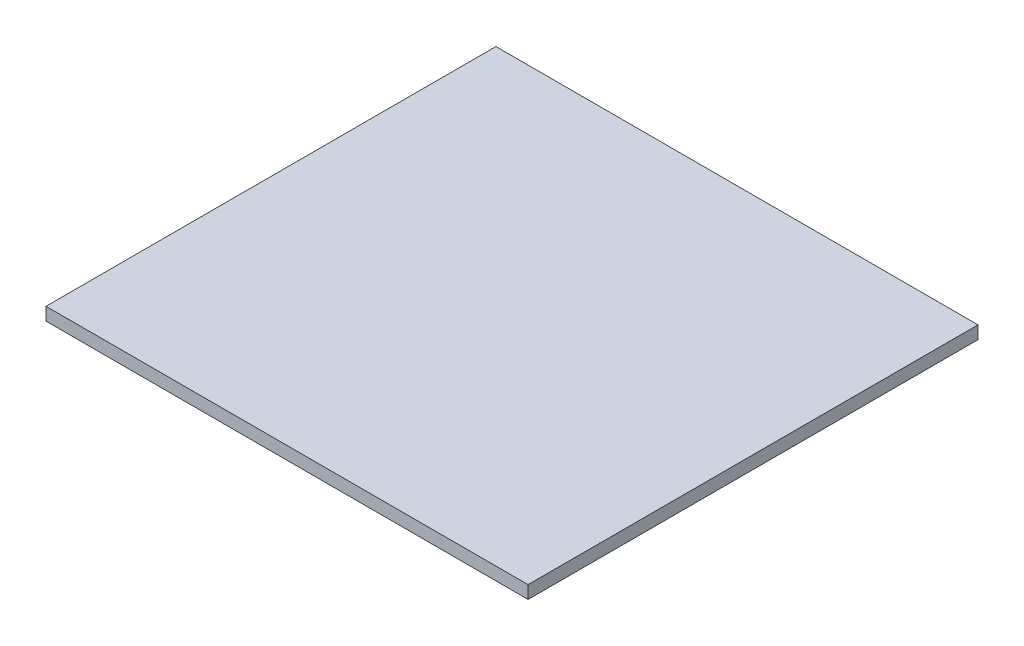
ISO-10303-21;
HEADER;
FILE_DESCRIPTION(('STEP AP214'),'2;1');
FILE_NAME('part.step','',(''),(''),'','','');
FILE_SCHEMA(('AUTOMOTIVE_DESIGN { 1 0 10303 214 1 1 1 1 }'));
ENDSEC;
DATA;
#1=APPLICATION_CONTEXT('core data for automotive mechanical design processes');
#2=APPLICATION_PROTOCOL_DEFINITION('international standard','automotive_design',2000,#1);
#3=PRODUCT_CONTEXT('',#1,'mechanical');
#4=PRODUCT('Part','Part','',(#3));
#5=PRODUCT_RELATED_PRODUCT_CATEGORY('part','',(#4));
#6=PRODUCT_DEFINITION_FORMATION('','',#4);
#7=PRODUCT_DEFINITION_CONTEXT('part definition',#1,'design');
#8=PRODUCT_DEFINITION('design','',#6,#7);
#9=PRODUCT_DEFINITION_SHAPE('','',#8);
#10=(LENGTH_UNIT() NAMED_UNIT(*) SI_UNIT(.MILLI.,.METRE.));
#11=(NAMED_UNIT(*) PLANE_ANGLE_UNIT() SI_UNIT($,.RADIAN.));
#12=(NAMED_UNIT(*) SI_UNIT($,.STERADIAN.) SOLID_ANGLE_UNIT());
#13=UNCERTAINTY_MEASURE_WITH_UNIT(LENGTH_MEASURE(1.E-05),#10,'distance_accuracy_value','');
#14=(GEOMETRIC_REPRESENTATION_CONTEXT(3) GLOBAL_UNCERTAINTY_ASSIGNED_CONTEXT((#13)) GLOBAL_UNIT_ASSIGNED_CONTEXT((#10,
#11,#12)) REPRESENTATION_CONTEXT('',''));
#15=CARTESIAN_POINT('',(0.,0.,0.));
#16=DIRECTION('',(0.,0.,1.));
#17=DIRECTION('',(1.,0.,0.));
#18=AXIS2_PLACEMENT_3D('',#15,#16,#17);
#19=CARTESIAN_POINT('',(-23.3544303797468,47.99,-47.8481012658228));
#20=DIRECTION('',(-1.,0.,0.));
#21=DIRECTION('',(0.,0.,1.));
#22=AXIS2_PLACEMENT_3D('',#19,#20,#21);
#23=PLANE('',#22);
#24=DIRECTION('',(0.,1.,0.));
#25=VECTOR('',#24,1.);
#26=CARTESIAN_POINT('',(-23.3544303797468,47.99,-47.8481012658228));
#27=LINE('',#26,#25);
#28=CARTESIAN_POINT('',(-23.3544303797468,48.,-47.8481012658228));
#29=VERTEX_POINT('',#28);
#30=CARTESIAN_POINT('',(-23.3544303797468,50.,-47.8481012658228));
#31=VERTEX_POINT('',#30);
#32=EDGE_CURVE('E36',#29,#31,#27,.T.);
#33=ORIENTED_EDGE('',*,*,#32,.T.);
#34=DIRECTION('',(0.,0.,1.));
#35=VECTOR('',#34,1.);
#36=CARTESIAN_POINT('',(-23.3544303797468,50.,0.));
#37=LINE('',#36,#35);
#38=CARTESIAN_POINT('',(-23.3544303797468,50.,22.1518987341772));
#39=VERTEX_POINT('',#38);
#40=EDGE_CURVE('E82',#31,#39,#37,.T.);
#41=ORIENTED_EDGE('',*,*,#40,.T.);
#42=DIRECTION('',(0.,1.,0.));
#43=VECTOR('',#42,1.);
#44=CARTESIAN_POINT('',(-23.3544303797468,47.99,22.1518987341772));
#45=LINE('',#44,#43);
#46=CARTESIAN_POINT('',(-23.3544303797468,48.,22.1518987341772));
#47=VERTEX_POINT('',#46);
#48=EDGE_CURVE('E77',#47,#39,#45,.T.);
#49=ORIENTED_EDGE('',*,*,#48,.F.);
#50=DIRECTION('',(0.,0.,1.));
#51=VECTOR('',#50,1.);
#52=CARTESIAN_POINT('',(-23.3544303797468,48.,0.));
#53=LINE('',#52,#51);
#54=EDGE_CURVE('E74',#29,#47,#53,.T.);
#55=ORIENTED_EDGE('',*,*,#54,.F.);
#56=EDGE_LOOP('',(#33,#41,#49,#55));
#57=FACE_BOUND('',#56,.T.);
#58=ADVANCED_FACE('F32',(#57),#23,.F.);
#59=CARTESIAN_POINT('',(-98.3544303797468,50.,22.1518987341772));
#60=DIRECTION('',(0.,0.,-1.));
#61=DIRECTION('',(-1.,0.,0.));
#62=AXIS2_PLACEMENT_3D('',#59,#60,#61);
#63=PLANE('',#62);
#64=DIRECTION('',(1.,0.,0.));
#65=VECTOR('',#64,1.);
#66=CARTESIAN_POINT('',(-98.3544303797468,48.,22.1518987341772));
#67=LINE('',#66,#65);
#68=CARTESIAN_POINT('',(-98.3544303797468,48.,22.1518987341772));
#69=VERTEX_POINT('',#68);
#70=EDGE_CURVE('E91',#69,#47,#67,.T.);
#71=ORIENTED_EDGE('',*,*,#70,.T.);
#72=ORIENTED_EDGE('',*,*,#48,.T.);
#73=DIRECTION('',(1.,0.,0.));
#74=VECTOR('',#73,1.);
#75=CARTESIAN_POINT('',(-98.3544303797468,50.,22.1518987341772));
#76=LINE('',#75,#74);
#77=CARTESIAN_POINT('',(-98.3544303797468,50.,22.1518987341772));
#78=VERTEX_POINT('',#77);
#79=EDGE_CURVE('E41',#78,#39,#76,.T.);
#80=ORIENTED_EDGE('',*,*,#79,.F.);
#81=DIRECTION('',(0.,-1.,0.));
#82=VECTOR('',#81,1.);
#83=CARTESIAN_POINT('',(-98.3544303797468,50.,22.1518987341772));
#84=LINE('',#83,#82);
#85=EDGE_CURVE('E90',#78,#69,#84,.T.);
#86=ORIENTED_EDGE('',*,*,#85,.T.);
#87=EDGE_LOOP('',(#71,#72,#80,#86));
#88=FACE_BOUND('',#87,.T.);
#89=ADVANCED_FACE('F103',(#88),#63,.F.);
#90=CARTESIAN_POINT('',(0.,50.,0.));
#91=DIRECTION('',(0.,1.,0.));
#92=DIRECTION('',(0.,0.,1.));
#93=AXIS2_PLACEMENT_3D('',#90,#91,#92);
#94=PLANE('',#93);
#95=ORIENTED_EDGE('',*,*,#40,.F.);
#96=DIRECTION('',(-1.,0.,0.));
#97=VECTOR('',#96,1.);
#98=CARTESIAN_POINT('',(-98.3544303797468,50.,-47.8481012658228));
#99=LINE('',#98,#97);
#100=CARTESIAN_POINT('',(-98.3544303797468,50.,-47.8481012658228));
#101=VERTEX_POINT('',#100);
#102=EDGE_CURVE('E54',#31,#101,#99,.T.);
#103=ORIENTED_EDGE('',*,*,#102,.T.);
#104=DIRECTION('',(0.,0.,1.));
#105=VECTOR('',#104,1.);
#106=CARTESIAN_POINT('',(-98.3544303797468,50.,-47.8481012658228));
#107=LINE('',#106,#105);
#108=EDGE_CURVE('E11',#101,#78,#107,.T.);
#109=ORIENTED_EDGE('',*,*,#108,.T.);
#110=ORIENTED_EDGE('',*,*,#79,.T.);
#111=EDGE_LOOP('',(#95,#103,#109,#110));
#112=FACE_BOUND('',#111,.T.);
#113=ADVANCED_FACE('F98',(#112),#94,.T.);
#114=CARTESIAN_POINT('',(-98.3544303797468,50.,-47.8481012658228));
#115=DIRECTION('',(1.,0.,0.));
#116=DIRECTION('',(0.,0.,-1.));
#117=AXIS2_PLACEMENT_3D('',#114,#115,#116);
#118=PLANE('',#117);
#119=DIRECTION('',(0.,-1.,0.));
#120=VECTOR('',#119,1.);
#121=CARTESIAN_POINT('',(-98.3544303797468,50.,-47.8481012658228));
#122=LINE('',#121,#120);
#123=CARTESIAN_POINT('',(-98.3544303797468,48.,-47.8481012658228));
#124=VERTEX_POINT('',#123);
#125=EDGE_CURVE('E93',#101,#124,#122,.T.);
#126=ORIENTED_EDGE('',*,*,#125,.T.);
#127=DIRECTION('',(0.,0.,1.));
#128=VECTOR('',#127,1.);
#129=CARTESIAN_POINT('',(-98.3544303797468,48.,-47.8481012658228));
#130=LINE('',#129,#128);
#131=EDGE_CURVE('E88',#124,#69,#130,.T.);
#132=ORIENTED_EDGE('',*,*,#131,.T.);
#133=ORIENTED_EDGE('',*,*,#85,.F.);
#134=ORIENTED_EDGE('',*,*,#108,.F.);
#135=EDGE_LOOP('',(#126,#132,#133,#134));
#136=FACE_BOUND('',#135,.T.);
#137=ADVANCED_FACE('F102',(#136),#118,.F.);
#138=CARTESIAN_POINT('',(0.,48.,0.));
#139=DIRECTION('',(0.,1.,0.));
#140=DIRECTION('',(0.,0.,1.));
#141=AXIS2_PLACEMENT_3D('',#138,#139,#140);
#142=PLANE('',#141);
#143=DIRECTION('',(-1.,0.,0.));
#144=VECTOR('',#143,1.);
#145=CARTESIAN_POINT('',(-98.3544303797468,48.,-47.8481012658228));
#146=LINE('',#145,#144);
#147=EDGE_CURVE('E86',#29,#124,#146,.T.);
#148=ORIENTED_EDGE('',*,*,#147,.F.);
#149=ORIENTED_EDGE('',*,*,#54,.T.);
#150=ORIENTED_EDGE('',*,*,#70,.F.);
#151=ORIENTED_EDGE('',*,*,#131,.F.);
#152=EDGE_LOOP('',(#148,#149,#150,#151));
#153=FACE_BOUND('',#152,.T.);
#154=ADVANCED_FACE('F34',(#153),#142,.F.);
#155=CARTESIAN_POINT('',(-98.3544303797468,50.,-47.8481012658228));
#156=DIRECTION('',(0.,0.,1.));
#157=DIRECTION('',(1.,0.,0.));
#158=AXIS2_PLACEMENT_3D('',#155,#156,#157);
#159=PLANE('',#158);
#160=ORIENTED_EDGE('',*,*,#32,.F.);
#161=ORIENTED_EDGE('',*,*,#147,.T.);
#162=ORIENTED_EDGE('',*,*,#125,.F.);
#163=ORIENTED_EDGE('',*,*,#102,.F.);
#164=EDGE_LOOP('',(#160,#161,#162,#163));
#165=FACE_BOUND('',#164,.T.);
#166=ADVANCED_FACE('F85',(#165),#159,.F.);
#167=CLOSED_SHELL('',(#58,#89,#113,#137,#154,#166));
#168=MANIFOLD_SOLID_BREP('B2',#167);
#169=ADVANCED_BREP_SHAPE_REPRESENTATION('',(#18,#168),#14);
#170=SHAPE_DEFINITION_REPRESENTATION(#9,#169);
ENDSEC;
END-ISO-10303-21;
